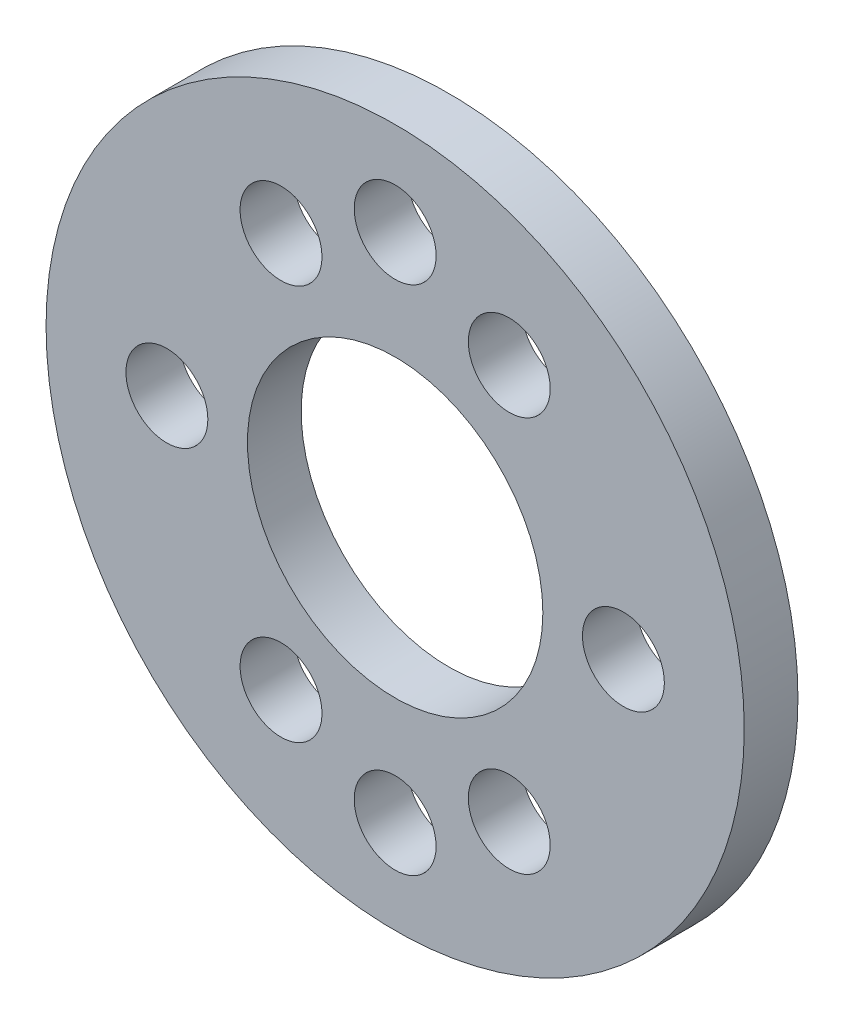
ISO-10303-21;
HEADER;
FILE_DESCRIPTION(('STEP AP214'),'2;1');
FILE_NAME('part.step','',(''),(''),'','','');
FILE_SCHEMA(('AUTOMOTIVE_DESIGN { 1 0 10303 214 1 1 1 1 }'));
ENDSEC;
DATA;
#1=APPLICATION_CONTEXT('core data for automotive mechanical design processes');
#2=APPLICATION_PROTOCOL_DEFINITION('international standard','automotive_design',2000,#1);
#3=PRODUCT_CONTEXT('',#1,'mechanical');
#4=PRODUCT('Part','Part','',(#3));
#5=PRODUCT_RELATED_PRODUCT_CATEGORY('part','',(#4));
#6=PRODUCT_DEFINITION_FORMATION('','',#4);
#7=PRODUCT_DEFINITION_CONTEXT('part definition',#1,'design');
#8=PRODUCT_DEFINITION('design','',#6,#7);
#9=PRODUCT_DEFINITION_SHAPE('','',#8);
#10=(LENGTH_UNIT() NAMED_UNIT(*) SI_UNIT(.MILLI.,.METRE.));
#11=(NAMED_UNIT(*) PLANE_ANGLE_UNIT() SI_UNIT($,.RADIAN.));
#12=(NAMED_UNIT(*) SI_UNIT($,.STERADIAN.) SOLID_ANGLE_UNIT());
#13=UNCERTAINTY_MEASURE_WITH_UNIT(LENGTH_MEASURE(1.E-05),#10,'distance_accuracy_value','');
#14=(GEOMETRIC_REPRESENTATION_CONTEXT(3) GLOBAL_UNCERTAINTY_ASSIGNED_CONTEXT((#13)) GLOBAL_UNIT_ASSIGNED_CONTEXT((#10,
#11,#12)) REPRESENTATION_CONTEXT('',''));
#15=CARTESIAN_POINT('',(0.,0.,0.));
#16=DIRECTION('',(0.,0.,1.));
#17=DIRECTION('',(1.,0.,0.));
#18=AXIS2_PLACEMENT_3D('',#15,#16,#17);
#19=CARTESIAN_POINT('',(0.,0.,2.));
#20=DIRECTION('',(0.,0.,1.));
#21=DIRECTION('',(1.,0.,0.));
#22=AXIS2_PLACEMENT_3D('',#19,#20,#21);
#23=PLANE('',#22);
#24=CARTESIAN_POINT('',(0.,-9.525,2.));
#25=DIRECTION('',(0.,0.,1.));
#26=DIRECTION('',(1.,0.,0.));
#27=AXIS2_PLACEMENT_3D('',#24,#25,#26);
#28=CIRCLE('',#27,1.525);
#29=CARTESIAN_POINT('',(1.525,-9.525,2.));
#30=VERTEX_POINT('',#29);
#31=EDGE_CURVE('E110',#30,#30,#28,.T.);
#32=ORIENTED_EDGE('',*,*,#31,.F.);
#33=EDGE_LOOP('',(#32));
#34=FACE_BOUND('',#33,.T.);
#35=CARTESIAN_POINT('',(4.24999999999998,-7.36121593216774,2.));
#36=DIRECTION('',(0.,0.,1.));
#37=DIRECTION('',(-1.,0.,0.));
#38=AXIS2_PLACEMENT_3D('',#35,#36,#37);
#39=CIRCLE('',#38,1.525);
#40=CARTESIAN_POINT('',(2.72499999999998,-7.36121593216774,2.));
#41=VERTEX_POINT('',#40);
#42=EDGE_CURVE('E94',#41,#41,#39,.T.);
#43=ORIENTED_EDGE('',*,*,#42,.F.);
#44=EDGE_LOOP('',(#43));
#45=FACE_BOUND('',#44,.T.);
#46=CARTESIAN_POINT('',(-4.25000000000004,7.36121593216771,2.));
#47=DIRECTION('',(0.,0.,1.));
#48=DIRECTION('',(1.,0.,0.));
#49=AXIS2_PLACEMENT_3D('',#46,#47,#48);
#50=CIRCLE('',#49,1.525);
#51=CARTESIAN_POINT('',(-2.72500000000004,7.36121593216771,2.));
#52=VERTEX_POINT('',#51);
#53=EDGE_CURVE('E78',#52,#52,#50,.T.);
#54=ORIENTED_EDGE('',*,*,#53,.F.);
#55=EDGE_LOOP('',(#54));
#56=FACE_BOUND('',#55,.T.);
#57=CARTESIAN_POINT('',(-8.5,0.,2.));
#58=DIRECTION('',(0.,0.,1.));
#59=DIRECTION('',(1.,0.,0.));
#60=AXIS2_PLACEMENT_3D('',#57,#58,#59);
#61=CIRCLE('',#60,1.525);
#62=CARTESIAN_POINT('',(-6.975,0.,2.));
#63=VERTEX_POINT('',#62);
#64=EDGE_CURVE('E62',#63,#63,#61,.T.);
#65=ORIENTED_EDGE('',*,*,#64,.F.);
#66=EDGE_LOOP('',(#65));
#67=FACE_BOUND('',#66,.T.);
#68=CARTESIAN_POINT('',(0.,0.,2.));
#69=DIRECTION('',(0.,0.,1.));
#70=DIRECTION('',(1.,0.,0.));
#71=AXIS2_PLACEMENT_3D('',#68,#69,#70);
#72=CIRCLE('',#71,13.);
#73=CARTESIAN_POINT('',(13.,0.,2.));
#74=VERTEX_POINT('',#73);
#75=EDGE_CURVE('E10',#74,#74,#72,.T.);
#76=ORIENTED_EDGE('',*,*,#75,.T.);
#77=EDGE_LOOP('',(#76));
#78=FACE_BOUND('',#77,.T.);
#79=CARTESIAN_POINT('',(0.,0.,2.));
#80=DIRECTION('',(0.,0.,1.));
#81=DIRECTION('',(1.,0.,0.));
#82=AXIS2_PLACEMENT_3D('',#79,#80,#81);
#83=CIRCLE('',#82,5.5);
#84=CARTESIAN_POINT('',(5.5,0.,2.));
#85=VERTEX_POINT('',#84);
#86=EDGE_CURVE('E56',#85,#85,#83,.T.);
#87=ORIENTED_EDGE('',*,*,#86,.F.);
#88=EDGE_LOOP('',(#87));
#89=FACE_BOUND('',#88,.T.);
#90=CARTESIAN_POINT('',(8.5,0.,2.));
#91=DIRECTION('',(0.,0.,1.));
#92=DIRECTION('',(1.,0.,0.));
#93=AXIS2_PLACEMENT_3D('',#90,#91,#92);
#94=CIRCLE('',#93,1.525);
#95=CARTESIAN_POINT('',(10.025,0.,2.));
#96=VERTEX_POINT('',#95);
#97=EDGE_CURVE('E70',#96,#96,#94,.T.);
#98=ORIENTED_EDGE('',*,*,#97,.F.);
#99=EDGE_LOOP('',(#98));
#100=FACE_BOUND('',#99,.T.);
#101=CARTESIAN_POINT('',(4.24999999999998,7.36121593216774,2.));
#102=DIRECTION('',(0.,0.,1.));
#103=DIRECTION('',(1.,0.,0.));
#104=AXIS2_PLACEMENT_3D('',#101,#102,#103);
#105=CIRCLE('',#104,1.525);
#106=CARTESIAN_POINT('',(5.77499999999998,7.36121593216774,2.));
#107=VERTEX_POINT('',#106);
#108=EDGE_CURVE('E86',#107,#107,#105,.T.);
#109=ORIENTED_EDGE('',*,*,#108,.F.);
#110=EDGE_LOOP('',(#109));
#111=FACE_BOUND('',#110,.T.);
#112=CARTESIAN_POINT('',(-4.25000000000004,-7.36121593216771,2.));
#113=DIRECTION('',(0.,0.,1.));
#114=DIRECTION('',(-1.,0.,0.));
#115=AXIS2_PLACEMENT_3D('',#112,#113,#114);
#116=CIRCLE('',#115,1.525);
#117=CARTESIAN_POINT('',(-5.77500000000004,-7.36121593216771,2.));
#118=VERTEX_POINT('',#117);
#119=EDGE_CURVE('E102',#118,#118,#116,.T.);
#120=ORIENTED_EDGE('',*,*,#119,.F.);
#121=EDGE_LOOP('',(#120));
#122=FACE_BOUND('',#121,.T.);
#123=CARTESIAN_POINT('',(0.,9.525,2.));
#124=DIRECTION('',(0.,0.,1.));
#125=DIRECTION('',(1.,0.,0.));
#126=AXIS2_PLACEMENT_3D('',#123,#124,#125);
#127=CIRCLE('',#126,1.525);
#128=CARTESIAN_POINT('',(1.525,9.525,2.));
#129=VERTEX_POINT('',#128);
#130=EDGE_CURVE('E118',#129,#129,#127,.T.);
#131=ORIENTED_EDGE('',*,*,#130,.F.);
#132=EDGE_LOOP('',(#131));
#133=FACE_BOUND('',#132,.T.);
#134=ADVANCED_FACE('F43',(#34,#45,#56,#67,#78,#89,#100,#111,#122,#133),#23,.T.);
#135=CARTESIAN_POINT('',(0.,0.,0.));
#136=DIRECTION('',(0.,0.,1.));
#137=DIRECTION('',(1.,0.,0.));
#138=AXIS2_PLACEMENT_3D('',#135,#136,#137);
#139=PLANE('',#138);
#140=CARTESIAN_POINT('',(0.,0.,0.));
#141=DIRECTION('',(0.,0.,1.));
#142=DIRECTION('',(1.,0.,0.));
#143=AXIS2_PLACEMENT_3D('',#140,#141,#142);
#144=CIRCLE('',#143,13.);
#145=CARTESIAN_POINT('',(13.,0.,0.));
#146=VERTEX_POINT('',#145);
#147=EDGE_CURVE('E47',#146,#146,#144,.T.);
#148=ORIENTED_EDGE('',*,*,#147,.F.);
#149=EDGE_LOOP('',(#148));
#150=FACE_BOUND('',#149,.T.);
#151=CARTESIAN_POINT('',(0.,0.,0.));
#152=DIRECTION('',(0.,0.,1.));
#153=DIRECTION('',(1.,0.,0.));
#154=AXIS2_PLACEMENT_3D('',#151,#152,#153);
#155=CIRCLE('',#154,5.5);
#156=CARTESIAN_POINT('',(5.5,0.,0.));
#157=VERTEX_POINT('',#156);
#158=EDGE_CURVE('E58',#157,#157,#155,.T.);
#159=ORIENTED_EDGE('',*,*,#158,.T.);
#160=EDGE_LOOP('',(#159));
#161=FACE_BOUND('',#160,.T.);
#162=CARTESIAN_POINT('',(-8.5,0.,0.));
#163=DIRECTION('',(0.,0.,1.));
#164=DIRECTION('',(1.,0.,0.));
#165=AXIS2_PLACEMENT_3D('',#162,#163,#164);
#166=CIRCLE('',#165,1.525);
#167=CARTESIAN_POINT('',(-6.975,0.,0.));
#168=VERTEX_POINT('',#167);
#169=EDGE_CURVE('E66',#168,#168,#166,.T.);
#170=ORIENTED_EDGE('',*,*,#169,.T.);
#171=EDGE_LOOP('',(#170));
#172=FACE_BOUND('',#171,.T.);
#173=CARTESIAN_POINT('',(8.5,0.,0.));
#174=DIRECTION('',(0.,0.,1.));
#175=DIRECTION('',(1.,0.,0.));
#176=AXIS2_PLACEMENT_3D('',#173,#174,#175);
#177=CIRCLE('',#176,1.525);
#178=CARTESIAN_POINT('',(10.025,0.,0.));
#179=VERTEX_POINT('',#178);
#180=EDGE_CURVE('E74',#179,#179,#177,.T.);
#181=ORIENTED_EDGE('',*,*,#180,.T.);
#182=EDGE_LOOP('',(#181));
#183=FACE_BOUND('',#182,.T.);
#184=CARTESIAN_POINT('',(-4.25000000000004,7.36121593216771,0.));
#185=DIRECTION('',(0.,0.,1.));
#186=DIRECTION('',(1.,0.,0.));
#187=AXIS2_PLACEMENT_3D('',#184,#185,#186);
#188=CIRCLE('',#187,1.525);
#189=CARTESIAN_POINT('',(-2.72500000000004,7.36121593216771,0.));
#190=VERTEX_POINT('',#189);
#191=EDGE_CURVE('E82',#190,#190,#188,.T.);
#192=ORIENTED_EDGE('',*,*,#191,.T.);
#193=EDGE_LOOP('',(#192));
#194=FACE_BOUND('',#193,.T.);
#195=CARTESIAN_POINT('',(4.24999999999998,7.36121593216774,0.));
#196=DIRECTION('',(0.,0.,1.));
#197=DIRECTION('',(1.,0.,0.));
#198=AXIS2_PLACEMENT_3D('',#195,#196,#197);
#199=CIRCLE('',#198,1.525);
#200=CARTESIAN_POINT('',(5.77499999999998,7.36121593216774,0.));
#201=VERTEX_POINT('',#200);
#202=EDGE_CURVE('E90',#201,#201,#199,.T.);
#203=ORIENTED_EDGE('',*,*,#202,.T.);
#204=EDGE_LOOP('',(#203));
#205=FACE_BOUND('',#204,.T.);
#206=CARTESIAN_POINT('',(4.24999999999998,-7.36121593216774,0.));
#207=DIRECTION('',(0.,0.,1.));
#208=DIRECTION('',(-1.,0.,0.));
#209=AXIS2_PLACEMENT_3D('',#206,#207,#208);
#210=CIRCLE('',#209,1.525);
#211=CARTESIAN_POINT('',(2.72499999999998,-7.36121593216774,0.));
#212=VERTEX_POINT('',#211);
#213=EDGE_CURVE('E98',#212,#212,#210,.T.);
#214=ORIENTED_EDGE('',*,*,#213,.T.);
#215=EDGE_LOOP('',(#214));
#216=FACE_BOUND('',#215,.T.);
#217=CARTESIAN_POINT('',(-4.25000000000004,-7.36121593216771,0.));
#218=DIRECTION('',(0.,0.,1.));
#219=DIRECTION('',(-1.,0.,0.));
#220=AXIS2_PLACEMENT_3D('',#217,#218,#219);
#221=CIRCLE('',#220,1.525);
#222=CARTESIAN_POINT('',(-5.77500000000004,-7.36121593216771,0.));
#223=VERTEX_POINT('',#222);
#224=EDGE_CURVE('E106',#223,#223,#221,.T.);
#225=ORIENTED_EDGE('',*,*,#224,.T.);
#226=EDGE_LOOP('',(#225));
#227=FACE_BOUND('',#226,.T.);
#228=CARTESIAN_POINT('',(0.,-9.525,0.));
#229=DIRECTION('',(0.,0.,1.));
#230=DIRECTION('',(1.,0.,0.));
#231=AXIS2_PLACEMENT_3D('',#228,#229,#230);
#232=CIRCLE('',#231,1.525);
#233=CARTESIAN_POINT('',(1.525,-9.525,0.));
#234=VERTEX_POINT('',#233);
#235=EDGE_CURVE('E114',#234,#234,#232,.T.);
#236=ORIENTED_EDGE('',*,*,#235,.T.);
#237=EDGE_LOOP('',(#236));
#238=FACE_BOUND('',#237,.T.);
#239=CARTESIAN_POINT('',(0.,9.525,0.));
#240=DIRECTION('',(0.,0.,1.));
#241=DIRECTION('',(1.,0.,0.));
#242=AXIS2_PLACEMENT_3D('',#239,#240,#241);
#243=CIRCLE('',#242,1.525);
#244=CARTESIAN_POINT('',(1.525,9.525,0.));
#245=VERTEX_POINT('',#244);
#246=EDGE_CURVE('E122',#245,#245,#243,.T.);
#247=ORIENTED_EDGE('',*,*,#246,.T.);
#248=EDGE_LOOP('',(#247));
#249=FACE_BOUND('',#248,.T.);
#250=ADVANCED_FACE('F134',(#150,#161,#172,#183,#194,#205,#216,#227,#238,#249),#139,.F.);
#251=CARTESIAN_POINT('',(0.,0.,2.));
#252=DIRECTION('',(0.,0.,-1.));
#253=DIRECTION('',(-1.,0.,0.));
#254=AXIS2_PLACEMENT_3D('',#251,#252,#253);
#255=CYLINDRICAL_SURFACE('',#254,13.);
#256=ORIENTED_EDGE('',*,*,#75,.F.);
#257=EDGE_LOOP('',(#256));
#258=FACE_BOUND('',#257,.T.);
#259=ORIENTED_EDGE('',*,*,#147,.T.);
#260=EDGE_LOOP('',(#259));
#261=FACE_BOUND('',#260,.T.);
#262=ADVANCED_FACE('F45',(#258,#261),#255,.T.);
#263=CARTESIAN_POINT('',(0.,0.,2.));
#264=DIRECTION('',(0.,0.,-1.));
#265=DIRECTION('',(-1.,0.,0.));
#266=AXIS2_PLACEMENT_3D('',#263,#264,#265);
#267=CYLINDRICAL_SURFACE('',#266,5.5);
#268=ORIENTED_EDGE('',*,*,#86,.T.);
#269=EDGE_LOOP('',(#268));
#270=FACE_BOUND('',#269,.T.);
#271=ORIENTED_EDGE('',*,*,#158,.F.);
#272=EDGE_LOOP('',(#271));
#273=FACE_BOUND('',#272,.T.);
#274=ADVANCED_FACE('F144',(#270,#273),#267,.F.);
#275=CARTESIAN_POINT('',(-8.5,0.,2.));
#276=DIRECTION('',(0.,0.,-1.));
#277=DIRECTION('',(-1.,0.,0.));
#278=AXIS2_PLACEMENT_3D('',#275,#276,#277);
#279=CYLINDRICAL_SURFACE('',#278,1.525);
#280=ORIENTED_EDGE('',*,*,#64,.T.);
#281=EDGE_LOOP('',(#280));
#282=FACE_BOUND('',#281,.T.);
#283=ORIENTED_EDGE('',*,*,#169,.F.);
#284=EDGE_LOOP('',(#283));
#285=FACE_BOUND('',#284,.T.);
#286=ADVANCED_FACE('F147',(#282,#285),#279,.F.);
#287=CARTESIAN_POINT('',(8.5,0.,2.));
#288=DIRECTION('',(0.,0.,-1.));
#289=DIRECTION('',(-1.,0.,0.));
#290=AXIS2_PLACEMENT_3D('',#287,#288,#289);
#291=CYLINDRICAL_SURFACE('',#290,1.525);
#292=ORIENTED_EDGE('',*,*,#97,.T.);
#293=EDGE_LOOP('',(#292));
#294=FACE_BOUND('',#293,.T.);
#295=ORIENTED_EDGE('',*,*,#180,.F.);
#296=EDGE_LOOP('',(#295));
#297=FACE_BOUND('',#296,.T.);
#298=ADVANCED_FACE('F151',(#294,#297),#291,.F.);
#299=CARTESIAN_POINT('',(-4.25000000000004,7.36121593216771,2.));
#300=DIRECTION('',(0.,0.,-1.));
#301=DIRECTION('',(-1.,0.,0.));
#302=AXIS2_PLACEMENT_3D('',#299,#300,#301);
#303=CYLINDRICAL_SURFACE('',#302,1.525);
#304=ORIENTED_EDGE('',*,*,#53,.T.);
#305=EDGE_LOOP('',(#304));
#306=FACE_BOUND('',#305,.T.);
#307=ORIENTED_EDGE('',*,*,#191,.F.);
#308=EDGE_LOOP('',(#307));
#309=FACE_BOUND('',#308,.T.);
#310=ADVANCED_FACE('F155',(#306,#309),#303,.F.);
#311=CARTESIAN_POINT('',(4.24999999999998,7.36121593216774,2.));
#312=DIRECTION('',(0.,0.,-1.));
#313=DIRECTION('',(-1.,0.,0.));
#314=AXIS2_PLACEMENT_3D('',#311,#312,#313);
#315=CYLINDRICAL_SURFACE('',#314,1.525);
#316=ORIENTED_EDGE('',*,*,#108,.T.);
#317=EDGE_LOOP('',(#316));
#318=FACE_BOUND('',#317,.T.);
#319=ORIENTED_EDGE('',*,*,#202,.F.);
#320=EDGE_LOOP('',(#319));
#321=FACE_BOUND('',#320,.T.);
#322=ADVANCED_FACE('F159',(#318,#321),#315,.F.);
#323=CARTESIAN_POINT('',(4.24999999999998,-7.36121593216774,2.));
#324=DIRECTION('',(0.,0.,-1.));
#325=DIRECTION('',(-1.,0.,0.));
#326=AXIS2_PLACEMENT_3D('',#323,#324,#325);
#327=CYLINDRICAL_SURFACE('',#326,1.525);
#328=ORIENTED_EDGE('',*,*,#42,.T.);
#329=EDGE_LOOP('',(#328));
#330=FACE_BOUND('',#329,.T.);
#331=ORIENTED_EDGE('',*,*,#213,.F.);
#332=EDGE_LOOP('',(#331));
#333=FACE_BOUND('',#332,.T.);
#334=ADVANCED_FACE('F163',(#330,#333),#327,.F.);
#335=CARTESIAN_POINT('',(-4.25000000000004,-7.36121593216771,2.));
#336=DIRECTION('',(0.,0.,-1.));
#337=DIRECTION('',(-1.,0.,0.));
#338=AXIS2_PLACEMENT_3D('',#335,#336,#337);
#339=CYLINDRICAL_SURFACE('',#338,1.525);
#340=ORIENTED_EDGE('',*,*,#119,.T.);
#341=EDGE_LOOP('',(#340));
#342=FACE_BOUND('',#341,.T.);
#343=ORIENTED_EDGE('',*,*,#224,.F.);
#344=EDGE_LOOP('',(#343));
#345=FACE_BOUND('',#344,.T.);
#346=ADVANCED_FACE('F167',(#342,#345),#339,.F.);
#347=CARTESIAN_POINT('',(0.,-9.525,2.));
#348=DIRECTION('',(0.,0.,-1.));
#349=DIRECTION('',(-1.,0.,0.));
#350=AXIS2_PLACEMENT_3D('',#347,#348,#349);
#351=CYLINDRICAL_SURFACE('',#350,1.525);
#352=ORIENTED_EDGE('',*,*,#31,.T.);
#353=EDGE_LOOP('',(#352));
#354=FACE_BOUND('',#353,.T.);
#355=ORIENTED_EDGE('',*,*,#235,.F.);
#356=EDGE_LOOP('',(#355));
#357=FACE_BOUND('',#356,.T.);
#358=ADVANCED_FACE('F171',(#354,#357),#351,.F.);
#359=CARTESIAN_POINT('',(0.,9.525,2.));
#360=DIRECTION('',(0.,0.,-1.));
#361=DIRECTION('',(-1.,0.,0.));
#362=AXIS2_PLACEMENT_3D('',#359,#360,#361);
#363=CYLINDRICAL_SURFACE('',#362,1.525);
#364=ORIENTED_EDGE('',*,*,#130,.T.);
#365=EDGE_LOOP('',(#364));
#366=FACE_BOUND('',#365,.T.);
#367=ORIENTED_EDGE('',*,*,#246,.F.);
#368=EDGE_LOOP('',(#367));
#369=FACE_BOUND('',#368,.T.);
#370=ADVANCED_FACE('F130',(#366,#369),#363,.F.);
#371=CLOSED_SHELL('',(#134,#250,#262,#274,#286,#298,#310,#322,#334,#346,#358,#370));
#372=MANIFOLD_SOLID_BREP('B2',#371);
#373=ADVANCED_BREP_SHAPE_REPRESENTATION('',(#18,#372),#14);
#374=SHAPE_DEFINITION_REPRESENTATION(#9,#373);
ENDSEC;
END-ISO-10303-21;
